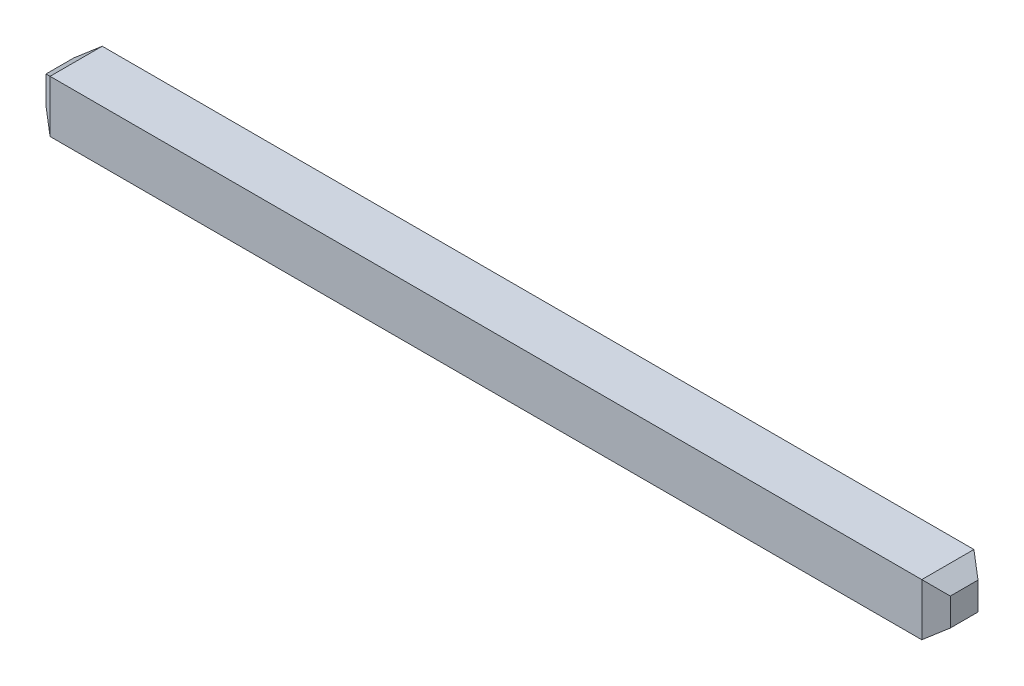
ISO-10303-21;
HEADER;
FILE_DESCRIPTION(('STEP AP214'),'2;1');
FILE_NAME('part.step','',(''),(''),'','','');
FILE_SCHEMA(('AUTOMOTIVE_DESIGN { 1 0 10303 214 1 1 1 1 }'));
ENDSEC;
DATA;
#1=APPLICATION_CONTEXT('core data for automotive mechanical design processes');
#2=APPLICATION_PROTOCOL_DEFINITION('international standard','automotive_design',2000,#1);
#3=PRODUCT_CONTEXT('',#1,'mechanical');
#4=PRODUCT('Part','Part','',(#3));
#5=PRODUCT_RELATED_PRODUCT_CATEGORY('part','',(#4));
#6=PRODUCT_DEFINITION_FORMATION('','',#4);
#7=PRODUCT_DEFINITION_CONTEXT('part definition',#1,'design');
#8=PRODUCT_DEFINITION('design','',#6,#7);
#9=PRODUCT_DEFINITION_SHAPE('','',#8);
#10=(LENGTH_UNIT() NAMED_UNIT(*) SI_UNIT(.MILLI.,.METRE.));
#11=(NAMED_UNIT(*) PLANE_ANGLE_UNIT() SI_UNIT($,.RADIAN.));
#12=(NAMED_UNIT(*) SI_UNIT($,.STERADIAN.) SOLID_ANGLE_UNIT());
#13=UNCERTAINTY_MEASURE_WITH_UNIT(LENGTH_MEASURE(1.E-05),#10,'distance_accuracy_value','');
#14=(GEOMETRIC_REPRESENTATION_CONTEXT(3) GLOBAL_UNCERTAINTY_ASSIGNED_CONTEXT((#13)) GLOBAL_UNIT_ASSIGNED_CONTEXT((#10,
#11,#12)) REPRESENTATION_CONTEXT('',''));
#15=CARTESIAN_POINT('',(0.,0.,0.));
#16=DIRECTION('',(0.,0.,1.));
#17=DIRECTION('',(1.,0.,0.));
#18=AXIS2_PLACEMENT_3D('',#15,#16,#17);
#19=CARTESIAN_POINT('',(-2.4,3.525,-36.83));
#20=DIRECTION('',(0.6,0.8,0.));
#21=DIRECTION('',(-0.8,0.6,0.));
#22=AXIS2_PLACEMENT_3D('',#19,#20,#21);
#23=PLANE('',#22);
#24=DIRECTION('',(0.,0.,1.));
#25=VECTOR('',#24,1.);
#26=CARTESIAN_POINT('',(-2.3,3.45,-36.83));
#27=LINE('',#26,#25);
#28=CARTESIAN_POINT('',(-2.29999999999978,3.45,-37.1499999999997));
#29=VERTEX_POINT('',#28);
#30=CARTESIAN_POINT('',(-2.29999999999978,3.45,-36.5100000000003));
#31=VERTEX_POINT('',#30);
#32=EDGE_CURVE('E105',#29,#31,#27,.T.);
#33=ORIENTED_EDGE('',*,*,#32,.T.);
#34=DIRECTION('',(0.685994340575993,-0.514495755427534,0.514495755419576));
#35=VECTOR('',#34,1.);
#36=CARTESIAN_POINT('',(-2.50000000000087,3.6,-36.6599999999988));
#37=LINE('',#36,#35);
#38=CARTESIAN_POINT('',(-2.50000000000022,3.6,-36.6599999999997));
#39=VERTEX_POINT('',#38);
#40=EDGE_CURVE('E92',#39,#31,#37,.T.);
#41=ORIENTED_EDGE('',*,*,#40,.F.);
#42=DIRECTION('',(0.,0.,-1.));
#43=VECTOR('',#42,1.);
#44=CARTESIAN_POINT('',(-2.5,3.6,-36.83));
#45=LINE('',#44,#43);
#46=CARTESIAN_POINT('',(-2.50000000000043,3.6,-37.0000000000006));
#47=VERTEX_POINT('',#46);
#48=EDGE_CURVE('E79',#39,#47,#45,.T.);
#49=ORIENTED_EDGE('',*,*,#48,.T.);
#50=DIRECTION('',(0.685994340575954,-0.514495755427524,-0.514495755419637));
#51=VECTOR('',#50,1.);
#52=CARTESIAN_POINT('',(-2.50000000000087,3.6,-37.0000000000012));
#53=LINE('',#52,#51);
#54=EDGE_CURVE('E20',#47,#29,#53,.T.);
#55=ORIENTED_EDGE('',*,*,#54,.T.);
#56=EDGE_LOOP('',(#33,#41,#49,#55));
#57=FACE_BOUND('',#56,.T.);
#58=ADVANCED_FACE('F17',(#57),#23,.F.);
#59=CARTESIAN_POINT('',(8.5,3.525,-36.83));
#60=DIRECTION('',(-0.6,0.8,0.));
#61=DIRECTION('',(-0.8,-0.6,0.));
#62=AXIS2_PLACEMENT_3D('',#59,#60,#61);
#63=PLANE('',#62);
#64=DIRECTION('',(0.,0.,-1.));
#65=VECTOR('',#64,1.);
#66=CARTESIAN_POINT('',(8.6,3.6,-36.83));
#67=LINE('',#66,#65);
#68=CARTESIAN_POINT('',(8.60000000000043,3.6,-36.6599999999994));
#69=VERTEX_POINT('',#68);
#70=CARTESIAN_POINT('',(8.60000000000022,3.6,-37.0000000000003));
#71=VERTEX_POINT('',#70);
#72=EDGE_CURVE('E114',#69,#71,#67,.T.);
#73=ORIENTED_EDGE('',*,*,#72,.F.);
#74=DIRECTION('',(0.685994340575992,0.514495755427534,-0.514495755419576));
#75=VECTOR('',#74,1.);
#76=CARTESIAN_POINT('',(8.39999999999913,3.45,-36.5100000000012));
#77=LINE('',#76,#75);
#78=CARTESIAN_POINT('',(8.39999999999989,3.45,-36.5100000000001));
#79=VERTEX_POINT('',#78);
#80=EDGE_CURVE('E109',#79,#69,#77,.T.);
#81=ORIENTED_EDGE('',*,*,#80,.F.);
#82=DIRECTION('',(0.,0.,1.));
#83=VECTOR('',#82,1.);
#84=CARTESIAN_POINT('',(8.4,3.45,-36.83));
#85=LINE('',#84,#83);
#86=CARTESIAN_POINT('',(8.39999999999979,3.45,-37.1499999999997));
#87=VERTEX_POINT('',#86);
#88=EDGE_CURVE('E103',#79,#87,#85,.F.);
#89=ORIENTED_EDGE('',*,*,#88,.T.);
#90=DIRECTION('',(0.685994340575954,0.514495755427524,0.514495755419637));
#91=VECTOR('',#90,1.);
#92=CARTESIAN_POINT('',(8.39999999999914,3.45,-37.1499999999988));
#93=LINE('',#92,#91);
#94=EDGE_CURVE('E107',#87,#71,#93,.T.);
#95=ORIENTED_EDGE('',*,*,#94,.T.);
#96=EDGE_LOOP('',(#73,#81,#89,#95));
#97=FACE_BOUND('',#96,.T.);
#98=ADVANCED_FACE('F175',(#97),#63,.F.);
#99=CARTESIAN_POINT('',(-2.4,3.77,-37.075));
#100=DIRECTION('',(0.5999999999908,0.,0.8000000000069));
#101=DIRECTION('',(0.8000000000069,0.,-0.5999999999908));
#102=AXIS2_PLACEMENT_3D('',#99,#100,#101);
#103=PLANE('',#102);
#104=DIRECTION('',(0.,1.,0.));
#105=VECTOR('',#104,1.);
#106=CARTESIAN_POINT('',(-2.3,3.77,-37.15));
#107=LINE('',#106,#105);
#108=CARTESIAN_POINT('',(-2.29999999999957,4.09,-37.1499999999994));
#109=VERTEX_POINT('',#108);
#110=EDGE_CURVE('E88',#109,#29,#107,.F.);
#111=ORIENTED_EDGE('',*,*,#110,.T.);
#112=ORIENTED_EDGE('',*,*,#54,.F.);
#113=DIRECTION('',(0.,1.,0.));
#114=VECTOR('',#113,1.);
#115=CARTESIAN_POINT('',(-2.5,3.77,-37.));
#116=LINE('',#115,#114);
#117=CARTESIAN_POINT('',(-2.50000000000043,3.94,-37.0000000000006));
#118=VERTEX_POINT('',#117);
#119=EDGE_CURVE('E85',#47,#118,#116,.T.);
#120=ORIENTED_EDGE('',*,*,#119,.T.);
#121=DIRECTION('',(-0.68599434057003,-0.514495755427522,0.514495755427537));
#122=VECTOR('',#121,1.);
#123=CARTESIAN_POINT('',(-2.3,4.09,-37.15));
#124=LINE('',#123,#122);
#125=EDGE_CURVE('E126',#109,#118,#124,.T.);
#126=ORIENTED_EDGE('',*,*,#125,.F.);
#127=EDGE_LOOP('',(#111,#112,#120,#126));
#128=FACE_BOUND('',#127,.T.);
#129=ADVANCED_FACE('F84',(#128),#103,.F.);
#130=CARTESIAN_POINT('',(-2.5,3.77,-36.83));
#131=DIRECTION('',(1.,0.,0.));
#132=DIRECTION('',(0.,0.,-1.));
#133=AXIS2_PLACEMENT_3D('',#130,#131,#132);
#134=PLANE('',#133);
#135=DIRECTION('',(0.,1.,0.));
#136=VECTOR('',#135,1.);
#137=CARTESIAN_POINT('',(-2.50000000000087,3.77,-36.6599999999988));
#138=LINE('',#137,#136);
#139=CARTESIAN_POINT('',(-2.50000000000022,3.94,-36.6599999999997));
#140=VERTEX_POINT('',#139);
#141=EDGE_CURVE('E94',#140,#39,#138,.F.);
#142=ORIENTED_EDGE('',*,*,#141,.F.);
#143=DIRECTION('',(0.,0.,1.));
#144=VECTOR('',#143,1.);
#145=CARTESIAN_POINT('',(-2.5,3.94,-36.83));
#146=LINE('',#145,#144);
#147=EDGE_CURVE('E98',#118,#140,#146,.T.);
#148=ORIENTED_EDGE('',*,*,#147,.F.);
#149=ORIENTED_EDGE('',*,*,#119,.F.);
#150=ORIENTED_EDGE('',*,*,#48,.F.);
#151=EDGE_LOOP('',(#142,#148,#149,#150));
#152=FACE_BOUND('',#151,.T.);
#153=ADVANCED_FACE('F96',(#152),#134,.F.);
#154=CARTESIAN_POINT('',(-2.4,3.77,-36.585));
#155=DIRECTION('',(-0.599999999990736,0.,0.800000000006948));
#156=DIRECTION('',(0.800000000006948,0.,0.599999999990736));
#157=AXIS2_PLACEMENT_3D('',#154,#155,#156);
#158=PLANE('',#157);
#159=ORIENTED_EDGE('',*,*,#40,.T.);
#160=DIRECTION('',(0.,1.,0.));
#161=VECTOR('',#160,1.);
#162=CARTESIAN_POINT('',(-2.3,3.77,-36.51));
#163=LINE('',#162,#161);
#164=CARTESIAN_POINT('',(-2.29999999999957,4.09,-36.5100000000006));
#165=VERTEX_POINT('',#164);
#166=EDGE_CURVE('E132',#165,#31,#163,.F.);
#167=ORIENTED_EDGE('',*,*,#166,.F.);
#168=DIRECTION('',(0.685994340570039,0.514495755427529,0.51449575542752));
#169=VECTOR('',#168,1.);
#170=CARTESIAN_POINT('',(-2.5,3.94,-36.66));
#171=LINE('',#170,#169);
#172=EDGE_CURVE('E129',#140,#165,#171,.T.);
#173=ORIENTED_EDGE('',*,*,#172,.F.);
#174=ORIENTED_EDGE('',*,*,#141,.T.);
#175=EDGE_LOOP('',(#159,#167,#173,#174));
#176=FACE_BOUND('',#175,.T.);
#177=ADVANCED_FACE('F186',(#176),#158,.T.);
#178=CARTESIAN_POINT('',(3.05,3.45,-36.83));
#179=DIRECTION('',(0.,1.,0.));
#180=DIRECTION('',(0.,0.,1.));
#181=AXIS2_PLACEMENT_3D('',#178,#179,#180);
#182=PLANE('',#181);
#183=ORIENTED_EDGE('',*,*,#32,.F.);
#184=DIRECTION('',(1.,0.,0.));
#185=VECTOR('',#184,1.);
#186=CARTESIAN_POINT('',(3.05,3.45,-37.15));
#187=LINE('',#186,#185);
#188=EDGE_CURVE('E123',#29,#87,#187,.T.);
#189=ORIENTED_EDGE('',*,*,#188,.T.);
#190=ORIENTED_EDGE('',*,*,#88,.F.);
#191=DIRECTION('',(1.,0.,0.));
#192=VECTOR('',#191,1.);
#193=CARTESIAN_POINT('',(3.05,3.45,-36.51));
#194=LINE('',#193,#192);
#195=EDGE_CURVE('E135',#31,#79,#194,.T.);
#196=ORIENTED_EDGE('',*,*,#195,.F.);
#197=EDGE_LOOP('',(#183,#189,#190,#196));
#198=FACE_BOUND('',#197,.T.);
#199=ADVANCED_FACE('F179',(#198),#182,.F.);
#200=CARTESIAN_POINT('',(8.5,3.77,-37.075));
#201=DIRECTION('',(-0.5999999999908,0.,0.8000000000069));
#202=DIRECTION('',(0.8000000000069,0.,0.5999999999908));
#203=AXIS2_PLACEMENT_3D('',#200,#201,#202);
#204=PLANE('',#203);
#205=DIRECTION('',(0.,1.,0.));
#206=VECTOR('',#205,1.);
#207=CARTESIAN_POINT('',(8.6,3.77,-37.));
#208=LINE('',#207,#206);
#209=CARTESIAN_POINT('',(8.60000000000043,3.94,-37.0000000000006));
#210=VERTEX_POINT('',#209);
#211=EDGE_CURVE('E117',#71,#210,#208,.T.);
#212=ORIENTED_EDGE('',*,*,#211,.F.);
#213=ORIENTED_EDGE('',*,*,#94,.F.);
#214=DIRECTION('',(0.,1.,0.));
#215=VECTOR('',#214,1.);
#216=CARTESIAN_POINT('',(8.4,3.77,-37.15));
#217=LINE('',#216,#215);
#218=CARTESIAN_POINT('',(8.39999999999957,4.09,-37.1499999999994));
#219=VERTEX_POINT('',#218);
#220=EDGE_CURVE('E120',#87,#219,#217,.T.);
#221=ORIENTED_EDGE('',*,*,#220,.T.);
#222=DIRECTION('',(-0.685994340570029,0.514495755427522,-0.51449575542754));
#223=VECTOR('',#222,1.);
#224=CARTESIAN_POINT('',(8.6,3.94,-37.));
#225=LINE('',#224,#223);
#226=EDGE_CURVE('E140',#210,#219,#225,.T.);
#227=ORIENTED_EDGE('',*,*,#226,.F.);
#228=EDGE_LOOP('',(#212,#213,#221,#227));
#229=FACE_BOUND('',#228,.T.);
#230=ADVANCED_FACE('F167',(#229),#204,.F.);
#231=CARTESIAN_POINT('',(8.5,3.77,-36.585));
#232=DIRECTION('',(0.599999999990736,0.,0.800000000006948));
#233=DIRECTION('',(0.800000000006948,0.,-0.599999999990736));
#234=AXIS2_PLACEMENT_3D('',#231,#232,#233);
#235=PLANE('',#234);
#236=DIRECTION('',(0.685994340570037,-0.514495755427528,-0.514495755427522));
#237=VECTOR('',#236,1.);
#238=CARTESIAN_POINT('',(8.4,4.09,-36.51));
#239=LINE('',#238,#237);
#240=CARTESIAN_POINT('',(8.39999999999957,4.09,-36.5100000000006));
#241=VERTEX_POINT('',#240);
#242=CARTESIAN_POINT('',(8.60000000000043,3.94,-36.6599999999994));
#243=VERTEX_POINT('',#242);
#244=EDGE_CURVE('E35',#241,#243,#239,.T.);
#245=ORIENTED_EDGE('',*,*,#244,.F.);
#246=DIRECTION('',(0.,1.,0.));
#247=VECTOR('',#246,1.);
#248=CARTESIAN_POINT('',(8.4,3.77,-36.51));
#249=LINE('',#248,#247);
#250=EDGE_CURVE('E138',#79,#241,#249,.T.);
#251=ORIENTED_EDGE('',*,*,#250,.F.);
#252=ORIENTED_EDGE('',*,*,#80,.T.);
#253=DIRECTION('',(0.,1.,0.));
#254=VECTOR('',#253,1.);
#255=CARTESIAN_POINT('',(8.6,3.77,-36.66));
#256=LINE('',#255,#254);
#257=EDGE_CURVE('E111',#243,#69,#256,.F.);
#258=ORIENTED_EDGE('',*,*,#257,.F.);
#259=EDGE_LOOP('',(#245,#251,#252,#258));
#260=FACE_BOUND('',#259,.T.);
#261=ADVANCED_FACE('F211',(#260),#235,.T.);
#262=CARTESIAN_POINT('',(8.6,3.77,-36.83));
#263=DIRECTION('',(1.,0.,0.));
#264=DIRECTION('',(0.,0.,-1.));
#265=AXIS2_PLACEMENT_3D('',#262,#263,#264);
#266=PLANE('',#265);
#267=ORIENTED_EDGE('',*,*,#211,.T.);
#268=DIRECTION('',(0.,0.,1.));
#269=VECTOR('',#268,1.);
#270=CARTESIAN_POINT('',(8.6,3.94,-36.83));
#271=LINE('',#270,#269);
#272=EDGE_CURVE('E144',#243,#210,#271,.F.);
#273=ORIENTED_EDGE('',*,*,#272,.F.);
#274=ORIENTED_EDGE('',*,*,#257,.T.);
#275=ORIENTED_EDGE('',*,*,#72,.T.);
#276=EDGE_LOOP('',(#267,#273,#274,#275));
#277=FACE_BOUND('',#276,.T.);
#278=ADVANCED_FACE('F172',(#277),#266,.T.);
#279=CARTESIAN_POINT('',(3.05,3.77,-37.15));
#280=DIRECTION('',(0.,0.,1.));
#281=DIRECTION('',(1.,0.,0.));
#282=AXIS2_PLACEMENT_3D('',#279,#280,#281);
#283=PLANE('',#282);
#284=ORIENTED_EDGE('',*,*,#110,.F.);
#285=DIRECTION('',(1.,0.,0.));
#286=VECTOR('',#285,1.);
#287=CARTESIAN_POINT('',(3.05,4.09,-37.15));
#288=LINE('',#287,#286);
#289=EDGE_CURVE('E147',#219,#109,#288,.F.);
#290=ORIENTED_EDGE('',*,*,#289,.F.);
#291=ORIENTED_EDGE('',*,*,#220,.F.);
#292=ORIENTED_EDGE('',*,*,#188,.F.);
#293=EDGE_LOOP('',(#284,#290,#291,#292));
#294=FACE_BOUND('',#293,.T.);
#295=ADVANCED_FACE('F181',(#294),#283,.F.);
#296=CARTESIAN_POINT('',(-2.4,4.015,-36.83));
#297=DIRECTION('',(-0.6,0.8,0.));
#298=DIRECTION('',(-0.8,-0.6,0.));
#299=AXIS2_PLACEMENT_3D('',#296,#297,#298);
#300=PLANE('',#299);
#301=ORIENTED_EDGE('',*,*,#172,.T.);
#302=DIRECTION('',(0.,0.,1.));
#303=VECTOR('',#302,1.);
#304=CARTESIAN_POINT('',(-2.3,4.09,-36.83));
#305=LINE('',#304,#303);
#306=EDGE_CURVE('E150',#109,#165,#305,.T.);
#307=ORIENTED_EDGE('',*,*,#306,.F.);
#308=ORIENTED_EDGE('',*,*,#125,.T.);
#309=ORIENTED_EDGE('',*,*,#147,.T.);
#310=EDGE_LOOP('',(#301,#307,#308,#309));
#311=FACE_BOUND('',#310,.T.);
#312=ADVANCED_FACE('F183',(#311),#300,.T.);
#313=CARTESIAN_POINT('',(3.05,3.77,-36.51));
#314=DIRECTION('',(0.,0.,1.));
#315=DIRECTION('',(1.,0.,0.));
#316=AXIS2_PLACEMENT_3D('',#313,#314,#315);
#317=PLANE('',#316);
#318=ORIENTED_EDGE('',*,*,#195,.T.);
#319=ORIENTED_EDGE('',*,*,#250,.T.);
#320=DIRECTION('',(1.,0.,0.));
#321=VECTOR('',#320,1.);
#322=CARTESIAN_POINT('',(3.05,4.09,-36.51));
#323=LINE('',#322,#321);
#324=EDGE_CURVE('E26',#165,#241,#323,.T.);
#325=ORIENTED_EDGE('',*,*,#324,.F.);
#326=ORIENTED_EDGE('',*,*,#166,.T.);
#327=EDGE_LOOP('',(#318,#319,#325,#326));
#328=FACE_BOUND('',#327,.T.);
#329=ADVANCED_FACE('F160',(#328),#317,.T.);
#330=CARTESIAN_POINT('',(8.5,4.015,-36.83));
#331=DIRECTION('',(0.6,0.8,0.));
#332=DIRECTION('',(-0.8,0.6,0.));
#333=AXIS2_PLACEMENT_3D('',#330,#331,#332);
#334=PLANE('',#333);
#335=ORIENTED_EDGE('',*,*,#244,.T.);
#336=ORIENTED_EDGE('',*,*,#272,.T.);
#337=ORIENTED_EDGE('',*,*,#226,.T.);
#338=DIRECTION('',(0.,0.,1.));
#339=VECTOR('',#338,1.);
#340=CARTESIAN_POINT('',(8.4,4.09,-36.83));
#341=LINE('',#340,#339);
#342=EDGE_CURVE('E11',#241,#219,#341,.F.);
#343=ORIENTED_EDGE('',*,*,#342,.F.);
#344=EDGE_LOOP('',(#335,#336,#337,#343));
#345=FACE_BOUND('',#344,.T.);
#346=ADVANCED_FACE('F163',(#345),#334,.T.);
#347=CARTESIAN_POINT('',(3.05,4.09,-36.83));
#348=DIRECTION('',(0.,1.,0.));
#349=DIRECTION('',(0.,0.,1.));
#350=AXIS2_PLACEMENT_3D('',#347,#348,#349);
#351=PLANE('',#350);
#352=ORIENTED_EDGE('',*,*,#324,.T.);
#353=ORIENTED_EDGE('',*,*,#342,.T.);
#354=ORIENTED_EDGE('',*,*,#289,.T.);
#355=ORIENTED_EDGE('',*,*,#306,.T.);
#356=EDGE_LOOP('',(#352,#353,#354,#355));
#357=FACE_BOUND('',#356,.T.);
#358=ADVANCED_FACE('F156',(#357),#351,.T.);
#359=CLOSED_SHELL('',(#58,#98,#129,#153,#177,#199,#230,#261,#278,#295,#312,#329,#346,#358));
#360=MANIFOLD_SOLID_BREP('B1',#359);
#361=ADVANCED_BREP_SHAPE_REPRESENTATION('',(#18,#360),#14);
#362=SHAPE_DEFINITION_REPRESENTATION(#9,#361);
ENDSEC;
END-ISO-10303-21;
